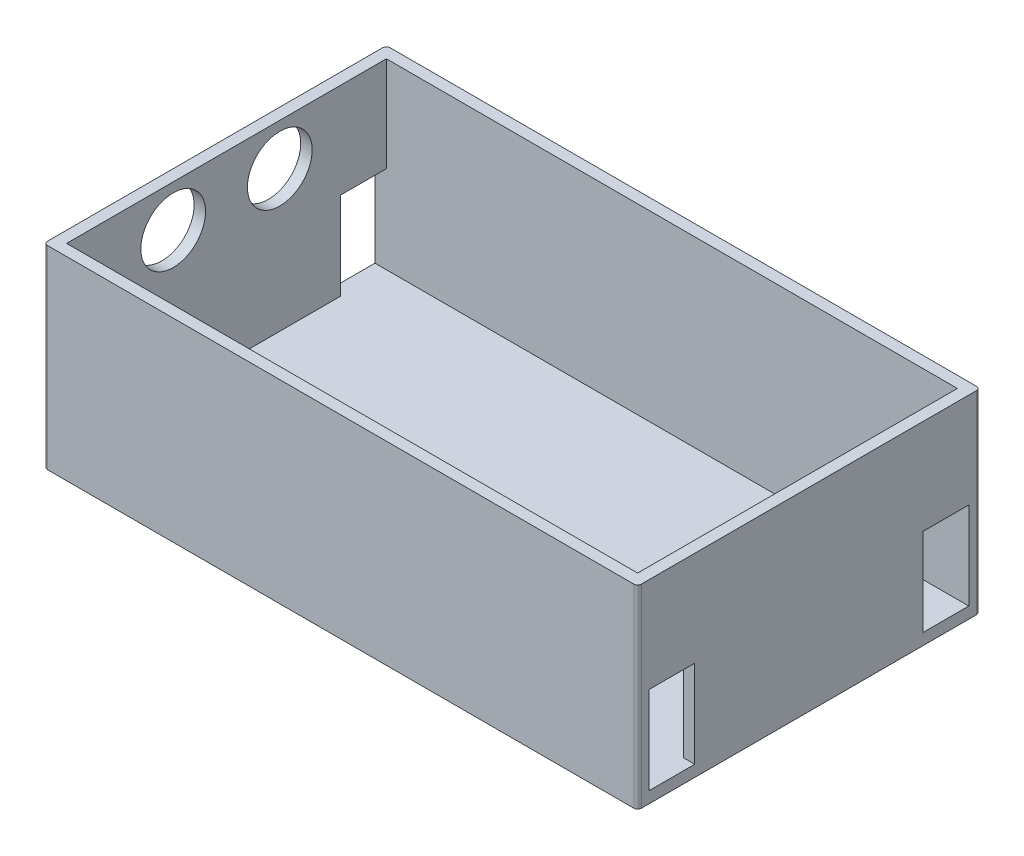
ISO-10303-21;
HEADER;
FILE_DESCRIPTION(('STEP AP214'),'2;1');
FILE_NAME('part.step','',(''),(''),'','','');
FILE_SCHEMA(('AUTOMOTIVE_DESIGN { 1 0 10303 214 1 1 1 1 }'));
ENDSEC;
DATA;
#1=APPLICATION_CONTEXT('core data for automotive mechanical design processes');
#2=APPLICATION_PROTOCOL_DEFINITION('international standard','automotive_design',2000,#1);
#3=PRODUCT_CONTEXT('',#1,'mechanical');
#4=PRODUCT('Part','Part','',(#3));
#5=PRODUCT_RELATED_PRODUCT_CATEGORY('part','',(#4));
#6=PRODUCT_DEFINITION_FORMATION('','',#4);
#7=PRODUCT_DEFINITION_CONTEXT('part definition',#1,'design');
#8=PRODUCT_DEFINITION('design','',#6,#7);
#9=PRODUCT_DEFINITION_SHAPE('','',#8);
#10=(LENGTH_UNIT() NAMED_UNIT(*) SI_UNIT(.MILLI.,.METRE.));
#11=(NAMED_UNIT(*) PLANE_ANGLE_UNIT() SI_UNIT($,.RADIAN.));
#12=(NAMED_UNIT(*) SI_UNIT($,.STERADIAN.) SOLID_ANGLE_UNIT());
#13=UNCERTAINTY_MEASURE_WITH_UNIT(LENGTH_MEASURE(1.E-05),#10,'distance_accuracy_value','');
#14=(GEOMETRIC_REPRESENTATION_CONTEXT(3) GLOBAL_UNCERTAINTY_ASSIGNED_CONTEXT((#13)) GLOBAL_UNIT_ASSIGNED_CONTEXT((#10,
#11,#12)) REPRESENTATION_CONTEXT('',''));
#15=CARTESIAN_POINT('',(0.,0.,0.));
#16=DIRECTION('',(0.,0.,1.));
#17=DIRECTION('',(1.,0.,0.));
#18=AXIS2_PLACEMENT_3D('',#15,#16,#17);
#19=CARTESIAN_POINT('',(0.,3.,0.));
#20=DIRECTION('',(1.,0.,0.));
#21=DIRECTION('',(0.,0.,-1.));
#22=AXIS2_PLACEMENT_3D('',#19,#20,#21);
#23=PLANE('',#22);
#24=CARTESIAN_POINT('',(0.,40.,-59.));
#25=DIRECTION('',(-1.,0.,0.));
#26=DIRECTION('',(0.,0.,1.));
#27=AXIS2_PLACEMENT_3D('',#24,#25,#26);
#28=CIRCLE('',#27,8.5);
#29=CARTESIAN_POINT('',(0.,40.,-50.5));
#30=VERTEX_POINT('',#29);
#31=EDGE_CURVE('E451',#30,#30,#28,.T.);
#32=ORIENTED_EDGE('',*,*,#31,.F.);
#33=EDGE_LOOP('',(#32));
#34=FACE_BOUND('',#33,.T.);
#35=CARTESIAN_POINT('',(0.,40.,-31.));
#36=DIRECTION('',(-1.,0.,0.));
#37=DIRECTION('',(0.,0.,1.));
#38=AXIS2_PLACEMENT_3D('',#35,#36,#37);
#39=CIRCLE('',#38,8.5);
#40=CARTESIAN_POINT('',(0.,40.,-22.5));
#41=VERTEX_POINT('',#40);
#42=EDGE_CURVE('E238',#41,#41,#39,.T.);
#43=ORIENTED_EDGE('',*,*,#42,.F.);
#44=EDGE_LOOP('',(#43));
#45=FACE_BOUND('',#44,.T.);
#46=DIRECTION('',(0.,0.,1.));
#47=VECTOR('',#46,1.);
#48=CARTESIAN_POINT('',(0.,26.,-3.));
#49=LINE('',#48,#47);
#50=CARTESIAN_POINT('',(0.,26.,-15.));
#51=VERTEX_POINT('',#50);
#52=CARTESIAN_POINT('',(0.,26.,-3.));
#53=VERTEX_POINT('',#52);
#54=EDGE_CURVE('E229',#51,#53,#49,.T.);
#55=ORIENTED_EDGE('',*,*,#54,.T.);
#56=DIRECTION('',(0.,-1.,0.));
#57=VECTOR('',#56,1.);
#58=CARTESIAN_POINT('',(0.,26.,-3.));
#59=LINE('',#58,#57);
#60=CARTESIAN_POINT('',(0.,3.,-3.));
#61=VERTEX_POINT('',#60);
#62=EDGE_CURVE('E208',#53,#61,#59,.T.);
#63=ORIENTED_EDGE('',*,*,#62,.T.);
#64=DIRECTION('',(0.,0.,-1.));
#65=VECTOR('',#64,1.);
#66=CARTESIAN_POINT('',(0.,3.,-3.));
#67=LINE('',#66,#65);
#68=CARTESIAN_POINT('',(0.,3.,-15.));
#69=VERTEX_POINT('',#68);
#70=EDGE_CURVE('E220',#61,#69,#67,.T.);
#71=ORIENTED_EDGE('',*,*,#70,.T.);
#72=DIRECTION('',(0.,1.,0.));
#73=VECTOR('',#72,1.);
#74=CARTESIAN_POINT('',(0.,26.,-15.));
#75=LINE('',#74,#73);
#76=EDGE_CURVE('E56',#69,#51,#75,.T.);
#77=ORIENTED_EDGE('',*,*,#76,.T.);
#78=EDGE_LOOP('',(#55,#63,#71,#77));
#79=FACE_BOUND('',#78,.T.);
#80=DIRECTION('',(0.,0.,-1.));
#81=VECTOR('',#80,1.);
#82=CARTESIAN_POINT('',(0.,3.,-87.));
#83=LINE('',#82,#81);
#84=CARTESIAN_POINT('',(0.,3.,-75.));
#85=VERTEX_POINT('',#84);
#86=CARTESIAN_POINT('',(0.,3.,-87.));
#87=VERTEX_POINT('',#86);
#88=EDGE_CURVE('E278',#85,#87,#83,.T.);
#89=ORIENTED_EDGE('',*,*,#88,.T.);
#90=DIRECTION('',(0.,1.,0.));
#91=VECTOR('',#90,1.);
#92=CARTESIAN_POINT('',(0.,3.,-87.));
#93=LINE('',#92,#91);
#94=CARTESIAN_POINT('',(0.,26.,-87.));
#95=VERTEX_POINT('',#94);
#96=EDGE_CURVE('E267',#87,#95,#93,.T.);
#97=ORIENTED_EDGE('',*,*,#96,.T.);
#98=DIRECTION('',(0.,0.,1.));
#99=VECTOR('',#98,1.);
#100=CARTESIAN_POINT('',(0.,26.,-87.));
#101=LINE('',#100,#99);
#102=CARTESIAN_POINT('',(0.,26.,-75.));
#103=VERTEX_POINT('',#102);
#104=EDGE_CURVE('E271',#95,#103,#101,.T.);
#105=ORIENTED_EDGE('',*,*,#104,.T.);
#106=DIRECTION('',(0.,-1.,0.));
#107=VECTOR('',#106,1.);
#108=CARTESIAN_POINT('',(0.,3.,-75.));
#109=LINE('',#108,#107);
#110=EDGE_CURVE('E64',#103,#85,#109,.T.);
#111=ORIENTED_EDGE('',*,*,#110,.T.);
#112=EDGE_LOOP('',(#89,#97,#105,#111));
#113=FACE_BOUND('',#112,.T.);
#114=DIRECTION('',(0.,0.,1.));
#115=VECTOR('',#114,1.);
#116=CARTESIAN_POINT('',(0.,51.,-90.));
#117=LINE('',#116,#115);
#118=CARTESIAN_POINT('',(0.,51.,-89.));
#119=VERTEX_POINT('',#118);
#120=CARTESIAN_POINT('',(0.,51.,-1.00000000000003));
#121=VERTEX_POINT('',#120);
#122=EDGE_CURVE('E370',#119,#121,#117,.T.);
#123=ORIENTED_EDGE('',*,*,#122,.F.);
#124=DIRECTION('',(0.,-1.,0.));
#125=VECTOR('',#124,1.);
#126=CARTESIAN_POINT('',(0.,3.,-89.));
#127=LINE('',#126,#125);
#128=CARTESIAN_POINT('',(0.,0.,-89.));
#129=VERTEX_POINT('',#128);
#130=EDGE_CURVE('E439',#119,#129,#127,.T.);
#131=ORIENTED_EDGE('',*,*,#130,.T.);
#132=DIRECTION('',(0.,0.,1.));
#133=VECTOR('',#132,1.);
#134=CARTESIAN_POINT('',(0.,0.,0.));
#135=LINE('',#134,#133);
#136=CARTESIAN_POINT('',(0.,0.,-1.));
#137=VERTEX_POINT('',#136);
#138=EDGE_CURVE('E382',#129,#137,#135,.T.);
#139=ORIENTED_EDGE('',*,*,#138,.T.);
#140=DIRECTION('',(0.,-1.,0.));
#141=VECTOR('',#140,1.);
#142=CARTESIAN_POINT('',(0.,3.,-1.));
#143=LINE('',#142,#141);
#144=EDGE_CURVE('E436',#137,#121,#143,.F.);
#145=ORIENTED_EDGE('',*,*,#144,.T.);
#146=EDGE_LOOP('',(#123,#131,#139,#145));
#147=FACE_BOUND('',#146,.T.);
#148=ADVANCED_FACE('F38',(#34,#45,#79,#113,#147),#23,.F.);
#149=CARTESIAN_POINT('',(0.,3.,0.));
#150=DIRECTION('',(0.,0.,-1.));
#151=DIRECTION('',(-1.,0.,0.));
#152=AXIS2_PLACEMENT_3D('',#149,#150,#151);
#153=PLANE('',#152);
#154=DIRECTION('',(1.,0.,0.));
#155=VECTOR('',#154,1.);
#156=CARTESIAN_POINT('',(0.,0.,0.));
#157=LINE('',#156,#155);
#158=CARTESIAN_POINT('',(1.,0.,0.));
#159=VERTEX_POINT('',#158);
#160=CARTESIAN_POINT('',(155.,0.,0.));
#161=VERTEX_POINT('',#160);
#162=EDGE_CURVE('E386',#159,#161,#157,.T.);
#163=ORIENTED_EDGE('',*,*,#162,.T.);
#164=DIRECTION('',(0.,-1.,0.));
#165=VECTOR('',#164,1.);
#166=CARTESIAN_POINT('',(155.,3.,0.));
#167=LINE('',#166,#165);
#168=CARTESIAN_POINT('',(155.,51.,0.));
#169=VERTEX_POINT('',#168);
#170=EDGE_CURVE('E48',#161,#169,#167,.F.);
#171=ORIENTED_EDGE('',*,*,#170,.T.);
#172=DIRECTION('',(1.,0.,0.));
#173=VECTOR('',#172,1.);
#174=CARTESIAN_POINT('',(0.,51.,0.));
#175=LINE('',#174,#173);
#176=CARTESIAN_POINT('',(1.,51.,0.));
#177=VERTEX_POINT('',#176);
#178=EDGE_CURVE('E374',#177,#169,#175,.T.);
#179=ORIENTED_EDGE('',*,*,#178,.F.);
#180=DIRECTION('',(0.,-1.,0.));
#181=VECTOR('',#180,1.);
#182=CARTESIAN_POINT('',(1.,3.,0.));
#183=LINE('',#182,#181);
#184=EDGE_CURVE('E443',#177,#159,#183,.T.);
#185=ORIENTED_EDGE('',*,*,#184,.T.);
#186=EDGE_LOOP('',(#163,#171,#179,#185));
#187=FACE_BOUND('',#186,.T.);
#188=ADVANCED_FACE('F467',(#187),#153,.F.);
#189=CARTESIAN_POINT('',(156.,3.,0.));
#190=DIRECTION('',(-1.,0.,0.));
#191=DIRECTION('',(0.,0.,1.));
#192=AXIS2_PLACEMENT_3D('',#189,#190,#191);
#193=PLANE('',#192);
#194=DIRECTION('',(0.,0.,-1.));
#195=VECTOR('',#194,1.);
#196=CARTESIAN_POINT('',(156.,3.,-3.));
#197=LINE('',#196,#195);
#198=CARTESIAN_POINT('',(156.,3.,-3.));
#199=VERTEX_POINT('',#198);
#200=CARTESIAN_POINT('',(156.,3.,-15.));
#201=VERTEX_POINT('',#200);
#202=EDGE_CURVE('E248',#199,#201,#197,.T.);
#203=ORIENTED_EDGE('',*,*,#202,.F.);
#204=DIRECTION('',(0.,-1.,0.));
#205=VECTOR('',#204,1.);
#206=CARTESIAN_POINT('',(156.,26.,-3.));
#207=LINE('',#206,#205);
#208=CARTESIAN_POINT('',(156.,26.,-3.));
#209=VERTEX_POINT('',#208);
#210=EDGE_CURVE('E211',#209,#199,#207,.T.);
#211=ORIENTED_EDGE('',*,*,#210,.F.);
#212=DIRECTION('',(0.,0.,1.));
#213=VECTOR('',#212,1.);
#214=CARTESIAN_POINT('',(156.,26.,-3.));
#215=LINE('',#214,#213);
#216=CARTESIAN_POINT('',(156.,26.,-15.));
#217=VERTEX_POINT('',#216);
#218=EDGE_CURVE('E231',#217,#209,#215,.T.);
#219=ORIENTED_EDGE('',*,*,#218,.F.);
#220=DIRECTION('',(0.,1.,0.));
#221=VECTOR('',#220,1.);
#222=CARTESIAN_POINT('',(156.,26.,-15.));
#223=LINE('',#222,#221);
#224=EDGE_CURVE('E235',#201,#217,#223,.T.);
#225=ORIENTED_EDGE('',*,*,#224,.F.);
#226=EDGE_LOOP('',(#203,#211,#219,#225));
#227=FACE_BOUND('',#226,.T.);
#228=DIRECTION('',(0.,0.,1.));
#229=VECTOR('',#228,1.);
#230=CARTESIAN_POINT('',(156.,26.,-87.));
#231=LINE('',#230,#229);
#232=CARTESIAN_POINT('',(156.,26.,-87.));
#233=VERTEX_POINT('',#232);
#234=CARTESIAN_POINT('',(156.,26.,-75.));
#235=VERTEX_POINT('',#234);
#236=EDGE_CURVE('E286',#233,#235,#231,.T.);
#237=ORIENTED_EDGE('',*,*,#236,.F.);
#238=DIRECTION('',(0.,1.,0.));
#239=VECTOR('',#238,1.);
#240=CARTESIAN_POINT('',(156.,3.,-87.));
#241=LINE('',#240,#239);
#242=CARTESIAN_POINT('',(156.,3.,-87.));
#243=VERTEX_POINT('',#242);
#244=EDGE_CURVE('E283',#243,#233,#241,.T.);
#245=ORIENTED_EDGE('',*,*,#244,.F.);
#246=DIRECTION('',(0.,0.,-1.));
#247=VECTOR('',#246,1.);
#248=CARTESIAN_POINT('',(156.,3.,-87.));
#249=LINE('',#248,#247);
#250=CARTESIAN_POINT('',(156.,3.,-75.));
#251=VERTEX_POINT('',#250);
#252=EDGE_CURVE('E272',#251,#243,#249,.T.);
#253=ORIENTED_EDGE('',*,*,#252,.F.);
#254=DIRECTION('',(0.,-1.,0.));
#255=VECTOR('',#254,1.);
#256=CARTESIAN_POINT('',(156.,3.,-75.));
#257=LINE('',#256,#255);
#258=EDGE_CURVE('E290',#235,#251,#257,.T.);
#259=ORIENTED_EDGE('',*,*,#258,.F.);
#260=EDGE_LOOP('',(#237,#245,#253,#259));
#261=FACE_BOUND('',#260,.T.);
#262=DIRECTION('',(0.,0.,-1.));
#263=VECTOR('',#262,1.);
#264=CARTESIAN_POINT('',(156.,0.,0.));
#265=LINE('',#264,#263);
#266=CARTESIAN_POINT('',(156.,0.,-1.));
#267=VERTEX_POINT('',#266);
#268=CARTESIAN_POINT('',(156.,0.,-89.));
#269=VERTEX_POINT('',#268);
#270=EDGE_CURVE('E390',#267,#269,#265,.T.);
#271=ORIENTED_EDGE('',*,*,#270,.T.);
#272=DIRECTION('',(0.,-1.,0.));
#273=VECTOR('',#272,1.);
#274=CARTESIAN_POINT('',(156.,3.,-89.));
#275=LINE('',#274,#273);
#276=CARTESIAN_POINT('',(156.,51.,-89.));
#277=VERTEX_POINT('',#276);
#278=EDGE_CURVE('E421',#269,#277,#275,.F.);
#279=ORIENTED_EDGE('',*,*,#278,.T.);
#280=DIRECTION('',(0.,0.,-1.));
#281=VECTOR('',#280,1.);
#282=CARTESIAN_POINT('',(156.,51.,0.));
#283=LINE('',#282,#281);
#284=CARTESIAN_POINT('',(156.,51.,-1.));
#285=VERTEX_POINT('',#284);
#286=EDGE_CURVE('E378',#285,#277,#283,.T.);
#287=ORIENTED_EDGE('',*,*,#286,.F.);
#288=DIRECTION('',(0.,-1.,0.));
#289=VECTOR('',#288,1.);
#290=CARTESIAN_POINT('',(156.,3.,-1.));
#291=LINE('',#290,#289);
#292=EDGE_CURVE('E417',#285,#267,#291,.T.);
#293=ORIENTED_EDGE('',*,*,#292,.T.);
#294=EDGE_LOOP('',(#271,#279,#287,#293));
#295=FACE_BOUND('',#294,.T.);
#296=ADVANCED_FACE('F475',(#227,#261,#295),#193,.F.);
#297=CARTESIAN_POINT('',(0.,3.,-90.));
#298=DIRECTION('',(0.,0.,1.));
#299=DIRECTION('',(1.,0.,0.));
#300=AXIS2_PLACEMENT_3D('',#297,#298,#299);
#301=PLANE('',#300);
#302=DIRECTION('',(-1.,0.,0.));
#303=VECTOR('',#302,1.);
#304=CARTESIAN_POINT('',(156.,51.,-90.));
#305=LINE('',#304,#303);
#306=CARTESIAN_POINT('',(155.,51.,-90.));
#307=VERTEX_POINT('',#306);
#308=CARTESIAN_POINT('',(1.,51.,-90.));
#309=VERTEX_POINT('',#308);
#310=EDGE_CURVE('E366',#307,#309,#305,.T.);
#311=ORIENTED_EDGE('',*,*,#310,.F.);
#312=DIRECTION('',(0.,-1.,0.));
#313=VECTOR('',#312,1.);
#314=CARTESIAN_POINT('',(155.,3.,-90.));
#315=LINE('',#314,#313);
#316=CARTESIAN_POINT('',(155.,0.,-90.));
#317=VERTEX_POINT('',#316);
#318=EDGE_CURVE('E401',#307,#317,#315,.T.);
#319=ORIENTED_EDGE('',*,*,#318,.T.);
#320=DIRECTION('',(-1.,0.,0.));
#321=VECTOR('',#320,1.);
#322=CARTESIAN_POINT('',(0.,0.,-90.));
#323=LINE('',#322,#321);
#324=CARTESIAN_POINT('',(1.,0.,-90.));
#325=VERTEX_POINT('',#324);
#326=EDGE_CURVE('E394',#317,#325,#323,.T.);
#327=ORIENTED_EDGE('',*,*,#326,.T.);
#328=DIRECTION('',(0.,-1.,0.));
#329=VECTOR('',#328,1.);
#330=CARTESIAN_POINT('',(1.,3.,-90.));
#331=LINE('',#330,#329);
#332=EDGE_CURVE('E398',#325,#309,#331,.F.);
#333=ORIENTED_EDGE('',*,*,#332,.T.);
#334=EDGE_LOOP('',(#311,#319,#327,#333));
#335=FACE_BOUND('',#334,.T.);
#336=ADVANCED_FACE('F511',(#335),#301,.F.);
#337=CARTESIAN_POINT('',(0.,0.,0.));
#338=DIRECTION('',(0.,-1.,0.));
#339=DIRECTION('',(0.,0.,-1.));
#340=AXIS2_PLACEMENT_3D('',#337,#338,#339);
#341=PLANE('',#340);
#342=ORIENTED_EDGE('',*,*,#326,.F.);
#343=CARTESIAN_POINT('',(155.,0.,-89.));
#344=DIRECTION('',(0.,-1.,0.));
#345=DIRECTION('',(0.,0.,-1.));
#346=AXIS2_PLACEMENT_3D('',#343,#344,#345);
#347=CIRCLE('',#346,1.);
#348=EDGE_CURVE('E414',#317,#269,#347,.T.);
#349=ORIENTED_EDGE('',*,*,#348,.T.);
#350=ORIENTED_EDGE('',*,*,#270,.F.);
#351=CARTESIAN_POINT('',(155.,0.,-1.));
#352=DIRECTION('',(0.,-1.,0.));
#353=DIRECTION('',(0.,0.,-1.));
#354=AXIS2_PLACEMENT_3D('',#351,#352,#353);
#355=CIRCLE('',#354,1.);
#356=EDGE_CURVE('E408',#267,#161,#355,.T.);
#357=ORIENTED_EDGE('',*,*,#356,.T.);
#358=ORIENTED_EDGE('',*,*,#162,.F.);
#359=CARTESIAN_POINT('',(1.,0.,-1.));
#360=DIRECTION('',(0.,-1.,0.));
#361=DIRECTION('',(0.,0.,-1.));
#362=AXIS2_PLACEMENT_3D('',#359,#360,#361);
#363=CIRCLE('',#362,1.);
#364=EDGE_CURVE('E405',#159,#137,#363,.T.);
#365=ORIENTED_EDGE('',*,*,#364,.T.);
#366=ORIENTED_EDGE('',*,*,#138,.F.);
#367=CARTESIAN_POINT('',(1.,0.,-89.));
#368=DIRECTION('',(0.,-1.,0.));
#369=DIRECTION('',(0.,0.,-1.));
#370=AXIS2_PLACEMENT_3D('',#367,#368,#369);
#371=CIRCLE('',#370,1.);
#372=EDGE_CURVE('E411',#129,#325,#371,.T.);
#373=ORIENTED_EDGE('',*,*,#372,.T.);
#374=EDGE_LOOP('',(#342,#349,#350,#357,#358,#365,#366,#373));
#375=FACE_BOUND('',#374,.T.);
#376=ADVANCED_FACE('F523',(#375),#341,.T.);
#377=CARTESIAN_POINT('',(0.,51.,0.));
#378=DIRECTION('',(0.,1.,0.));
#379=DIRECTION('',(0.,0.,1.));
#380=AXIS2_PLACEMENT_3D('',#377,#378,#379);
#381=PLANE('',#380);
#382=ORIENTED_EDGE('',*,*,#286,.T.);
#383=CARTESIAN_POINT('',(155.,51.,-89.));
#384=DIRECTION('',(0.,1.,0.));
#385=DIRECTION('',(0.,0.,1.));
#386=AXIS2_PLACEMENT_3D('',#383,#384,#385);
#387=CIRCLE('',#386,1.);
#388=EDGE_CURVE('E433',#277,#307,#387,.T.);
#389=ORIENTED_EDGE('',*,*,#388,.T.);
#390=ORIENTED_EDGE('',*,*,#310,.T.);
#391=CARTESIAN_POINT('',(1.,51.,-89.));
#392=DIRECTION('',(0.,1.,0.));
#393=DIRECTION('',(0.,0.,1.));
#394=AXIS2_PLACEMENT_3D('',#391,#392,#393);
#395=CIRCLE('',#394,1.);
#396=EDGE_CURVE('E430',#309,#119,#395,.T.);
#397=ORIENTED_EDGE('',*,*,#396,.T.);
#398=ORIENTED_EDGE('',*,*,#122,.T.);
#399=CARTESIAN_POINT('',(1.,51.,-1.));
#400=DIRECTION('',(0.,1.,0.));
#401=DIRECTION('',(0.,0.,1.));
#402=AXIS2_PLACEMENT_3D('',#399,#400,#401);
#403=CIRCLE('',#402,1.);
#404=EDGE_CURVE('E424',#121,#177,#403,.T.);
#405=ORIENTED_EDGE('',*,*,#404,.T.);
#406=ORIENTED_EDGE('',*,*,#178,.T.);
#407=CARTESIAN_POINT('',(155.,51.,-1.));
#408=DIRECTION('',(0.,1.,0.));
#409=DIRECTION('',(0.,0.,1.));
#410=AXIS2_PLACEMENT_3D('',#407,#408,#409);
#411=CIRCLE('',#410,1.);
#412=EDGE_CURVE('E427',#169,#285,#411,.T.);
#413=ORIENTED_EDGE('',*,*,#412,.T.);
#414=EDGE_LOOP('',(#382,#389,#390,#397,#398,#405,#406,#413));
#415=FACE_BOUND('',#414,.T.);
#416=DIRECTION('',(1.,0.,0.));
#417=VECTOR('',#416,1.);
#418=CARTESIAN_POINT('',(3.00000000000001,51.,-3.));
#419=LINE('',#418,#417);
#420=CARTESIAN_POINT('',(3.00000000000001,51.,-3.));
#421=VERTEX_POINT('',#420);
#422=CARTESIAN_POINT('',(153.,51.,-3.));
#423=VERTEX_POINT('',#422);
#424=EDGE_CURVE('E333',#421,#423,#419,.T.);
#425=ORIENTED_EDGE('',*,*,#424,.F.);
#426=DIRECTION('',(0.,0.,1.));
#427=VECTOR('',#426,1.);
#428=CARTESIAN_POINT('',(3.,51.,-87.));
#429=LINE('',#428,#427);
#430=CARTESIAN_POINT('',(3.,51.,-87.));
#431=VERTEX_POINT('',#430);
#432=EDGE_CURVE('E330',#431,#421,#429,.T.);
#433=ORIENTED_EDGE('',*,*,#432,.F.);
#434=DIRECTION('',(-1.,0.,0.));
#435=VECTOR('',#434,1.);
#436=CARTESIAN_POINT('',(3.,51.,-87.));
#437=LINE('',#436,#435);
#438=CARTESIAN_POINT('',(153.,51.,-87.));
#439=VERTEX_POINT('',#438);
#440=EDGE_CURVE('E341',#439,#431,#437,.T.);
#441=ORIENTED_EDGE('',*,*,#440,.F.);
#442=DIRECTION('',(0.,0.,-1.));
#443=VECTOR('',#442,1.);
#444=CARTESIAN_POINT('',(153.,51.,-87.));
#445=LINE('',#444,#443);
#446=EDGE_CURVE('E337',#423,#439,#445,.T.);
#447=ORIENTED_EDGE('',*,*,#446,.F.);
#448=EDGE_LOOP('',(#425,#433,#441,#447));
#449=FACE_BOUND('',#448,.T.);
#450=ADVANCED_FACE('F500',(#415,#449),#381,.T.);
#451=CARTESIAN_POINT('',(3.,51.,-87.));
#452=DIRECTION('',(1.,0.,0.));
#453=DIRECTION('',(0.,0.,-1.));
#454=AXIS2_PLACEMENT_3D('',#451,#452,#453);
#455=PLANE('',#454);
#456=CARTESIAN_POINT('',(3.,40.,-59.));
#457=DIRECTION('',(1.,0.,0.));
#458=DIRECTION('',(0.,0.,-1.));
#459=AXIS2_PLACEMENT_3D('',#456,#457,#458);
#460=CIRCLE('',#459,8.5);
#461=CARTESIAN_POINT('',(3.,40.,-67.5));
#462=VERTEX_POINT('',#461);
#463=EDGE_CURVE('E42',#462,#462,#460,.T.);
#464=ORIENTED_EDGE('',*,*,#463,.F.);
#465=EDGE_LOOP('',(#464));
#466=FACE_BOUND('',#465,.T.);
#467=CARTESIAN_POINT('',(3.00000000000001,40.,-31.));
#468=DIRECTION('',(1.,0.,0.));
#469=DIRECTION('',(0.,0.,-1.));
#470=AXIS2_PLACEMENT_3D('',#467,#468,#469);
#471=CIRCLE('',#470,8.5);
#472=CARTESIAN_POINT('',(3.00000000000001,40.,-39.5));
#473=VERTEX_POINT('',#472);
#474=EDGE_CURVE('E448',#473,#473,#471,.T.);
#475=ORIENTED_EDGE('',*,*,#474,.F.);
#476=EDGE_LOOP('',(#475));
#477=FACE_BOUND('',#476,.T.);
#478=DIRECTION('',(0.,0.,1.));
#479=VECTOR('',#478,1.);
#480=CARTESIAN_POINT('',(3.,26.,-87.));
#481=LINE('',#480,#479);
#482=CARTESIAN_POINT('',(3.00000000000001,26.,-15.));
#483=VERTEX_POINT('',#482);
#484=CARTESIAN_POINT('',(3.00000000000001,26.,-3.));
#485=VERTEX_POINT('',#484);
#486=EDGE_CURVE('E327',#483,#485,#481,.T.);
#487=ORIENTED_EDGE('',*,*,#486,.F.);
#488=DIRECTION('',(0.,1.,0.));
#489=VECTOR('',#488,1.);
#490=CARTESIAN_POINT('',(3.00000000000001,51.,-15.));
#491=LINE('',#490,#489);
#492=CARTESIAN_POINT('',(3.,3.,-15.));
#493=VERTEX_POINT('',#492);
#494=EDGE_CURVE('E318',#493,#483,#491,.T.);
#495=ORIENTED_EDGE('',*,*,#494,.F.);
#496=DIRECTION('',(0.,0.,1.));
#497=VECTOR('',#496,1.);
#498=CARTESIAN_POINT('',(3.,3.,-87.));
#499=LINE('',#498,#497);
#500=CARTESIAN_POINT('',(3.,3.,-75.));
#501=VERTEX_POINT('',#500);
#502=EDGE_CURVE('E217',#501,#493,#499,.T.);
#503=ORIENTED_EDGE('',*,*,#502,.F.);
#504=DIRECTION('',(0.,-1.,0.));
#505=VECTOR('',#504,1.);
#506=CARTESIAN_POINT('',(3.,51.,-75.));
#507=LINE('',#506,#505);
#508=CARTESIAN_POINT('',(3.,26.,-75.));
#509=VERTEX_POINT('',#508);
#510=EDGE_CURVE('E311',#509,#501,#507,.T.);
#511=ORIENTED_EDGE('',*,*,#510,.F.);
#512=DIRECTION('',(0.,0.,1.));
#513=VECTOR('',#512,1.);
#514=CARTESIAN_POINT('',(3.,26.,-87.));
#515=LINE('',#514,#513);
#516=CARTESIAN_POINT('',(3.,26.,-87.));
#517=VERTEX_POINT('',#516);
#518=EDGE_CURVE('E324',#517,#509,#515,.T.);
#519=ORIENTED_EDGE('',*,*,#518,.F.);
#520=DIRECTION('',(0.,-1.,0.));
#521=VECTOR('',#520,1.);
#522=CARTESIAN_POINT('',(3.,51.,-87.));
#523=LINE('',#522,#521);
#524=EDGE_CURVE('E344',#431,#517,#523,.T.);
#525=ORIENTED_EDGE('',*,*,#524,.F.);
#526=ORIENTED_EDGE('',*,*,#432,.T.);
#527=DIRECTION('',(0.,-1.,0.));
#528=VECTOR('',#527,1.);
#529=CARTESIAN_POINT('',(3.00000000000001,51.,-3.));
#530=LINE('',#529,#528);
#531=EDGE_CURVE('E362',#421,#485,#530,.T.);
#532=ORIENTED_EDGE('',*,*,#531,.T.);
#533=EDGE_LOOP('',(#487,#495,#503,#511,#519,#525,#526,#532));
#534=FACE_BOUND('',#533,.T.);
#535=ADVANCED_FACE('F530',(#466,#477,#534),#455,.T.);
#536=CARTESIAN_POINT('',(3.00000000000001,51.,-3.));
#537=DIRECTION('',(0.,0.,-1.));
#538=DIRECTION('',(-1.,0.,0.));
#539=AXIS2_PLACEMENT_3D('',#536,#537,#538);
#540=PLANE('',#539);
#541=DIRECTION('',(0.,-1.,0.));
#542=VECTOR('',#541,1.);
#543=CARTESIAN_POINT('',(153.,51.,-3.));
#544=LINE('',#543,#542);
#545=CARTESIAN_POINT('',(153.,26.,-3.));
#546=VERTEX_POINT('',#545);
#547=EDGE_CURVE('E359',#423,#546,#544,.T.);
#548=ORIENTED_EDGE('',*,*,#547,.T.);
#549=DIRECTION('',(1.,0.,0.));
#550=VECTOR('',#549,1.);
#551=CARTESIAN_POINT('',(0.,26.,-3.));
#552=LINE('',#551,#550);
#553=EDGE_CURVE('E259',#546,#209,#552,.T.);
#554=ORIENTED_EDGE('',*,*,#553,.T.);
#555=ORIENTED_EDGE('',*,*,#210,.T.);
#556=DIRECTION('',(1.,0.,0.));
#557=VECTOR('',#556,1.);
#558=CARTESIAN_POINT('',(3.00000000000001,3.,-3.));
#559=LINE('',#558,#557);
#560=EDGE_CURVE('E202',#61,#199,#559,.T.);
#561=ORIENTED_EDGE('',*,*,#560,.F.);
#562=ORIENTED_EDGE('',*,*,#62,.F.);
#563=EDGE_CURVE('E255',#53,#485,#552,.T.);
#564=ORIENTED_EDGE('',*,*,#563,.T.);
#565=ORIENTED_EDGE('',*,*,#531,.F.);
#566=ORIENTED_EDGE('',*,*,#424,.T.);
#567=EDGE_LOOP('',(#548,#554,#555,#561,#562,#564,#565,#566));
#568=FACE_BOUND('',#567,.T.);
#569=ADVANCED_FACE('F205',(#568),#540,.T.);
#570=CARTESIAN_POINT('',(153.,51.,-87.));
#571=DIRECTION('',(-1.,0.,0.));
#572=DIRECTION('',(0.,0.,1.));
#573=AXIS2_PLACEMENT_3D('',#570,#571,#572);
#574=PLANE('',#573);
#575=DIRECTION('',(0.,0.,-1.));
#576=VECTOR('',#575,1.);
#577=CARTESIAN_POINT('',(153.,26.,-87.));
#578=LINE('',#577,#576);
#579=CARTESIAN_POINT('',(153.,26.,-15.));
#580=VERTEX_POINT('',#579);
#581=EDGE_CURVE('E11',#546,#580,#578,.T.);
#582=ORIENTED_EDGE('',*,*,#581,.F.);
#583=ORIENTED_EDGE('',*,*,#547,.F.);
#584=ORIENTED_EDGE('',*,*,#446,.T.);
#585=DIRECTION('',(0.,-1.,0.));
#586=VECTOR('',#585,1.);
#587=CARTESIAN_POINT('',(153.,51.,-87.));
#588=LINE('',#587,#586);
#589=CARTESIAN_POINT('',(153.,26.,-87.));
#590=VERTEX_POINT('',#589);
#591=EDGE_CURVE('E355',#439,#590,#588,.T.);
#592=ORIENTED_EDGE('',*,*,#591,.T.);
#593=DIRECTION('',(0.,0.,-1.));
#594=VECTOR('',#593,1.);
#595=CARTESIAN_POINT('',(153.,26.,-87.));
#596=LINE('',#595,#594);
#597=CARTESIAN_POINT('',(153.,26.,-75.));
#598=VERTEX_POINT('',#597);
#599=EDGE_CURVE('E321',#598,#590,#596,.T.);
#600=ORIENTED_EDGE('',*,*,#599,.F.);
#601=DIRECTION('',(0.,1.,0.));
#602=VECTOR('',#601,1.);
#603=CARTESIAN_POINT('',(153.,51.,-75.));
#604=LINE('',#603,#602);
#605=CARTESIAN_POINT('',(153.,3.,-75.));
#606=VERTEX_POINT('',#605);
#607=EDGE_CURVE('E258',#606,#598,#604,.T.);
#608=ORIENTED_EDGE('',*,*,#607,.F.);
#609=DIRECTION('',(0.,0.,-1.));
#610=VECTOR('',#609,1.);
#611=CARTESIAN_POINT('',(153.,3.,-87.));
#612=LINE('',#611,#610);
#613=CARTESIAN_POINT('',(153.,3.,-15.));
#614=VERTEX_POINT('',#613);
#615=EDGE_CURVE('E216',#614,#606,#612,.T.);
#616=ORIENTED_EDGE('',*,*,#615,.F.);
#617=DIRECTION('',(0.,-1.,0.));
#618=VECTOR('',#617,1.);
#619=CARTESIAN_POINT('',(153.,51.,-15.));
#620=LINE('',#619,#618);
#621=EDGE_CURVE('E314',#580,#614,#620,.T.);
#622=ORIENTED_EDGE('',*,*,#621,.F.);
#623=EDGE_LOOP('',(#582,#583,#584,#592,#600,#608,#616,#622));
#624=FACE_BOUND('',#623,.T.);
#625=ADVANCED_FACE('F558',(#624),#574,.T.);
#626=CARTESIAN_POINT('',(3.,51.,-87.));
#627=DIRECTION('',(0.,0.,1.));
#628=DIRECTION('',(1.,0.,0.));
#629=AXIS2_PLACEMENT_3D('',#626,#627,#628);
#630=PLANE('',#629);
#631=ORIENTED_EDGE('',*,*,#524,.T.);
#632=DIRECTION('',(1.,0.,0.));
#633=VECTOR('',#632,1.);
#634=CARTESIAN_POINT('',(0.,26.,-87.));
#635=LINE('',#634,#633);
#636=EDGE_CURVE('E305',#95,#517,#635,.T.);
#637=ORIENTED_EDGE('',*,*,#636,.F.);
#638=ORIENTED_EDGE('',*,*,#96,.F.);
#639=DIRECTION('',(-1.,0.,0.));
#640=VECTOR('',#639,1.);
#641=CARTESIAN_POINT('',(3.,3.,-87.));
#642=LINE('',#641,#640);
#643=EDGE_CURVE('E334',#243,#87,#642,.T.);
#644=ORIENTED_EDGE('',*,*,#643,.F.);
#645=ORIENTED_EDGE('',*,*,#244,.T.);
#646=EDGE_CURVE('E282',#590,#233,#635,.T.);
#647=ORIENTED_EDGE('',*,*,#646,.F.);
#648=ORIENTED_EDGE('',*,*,#591,.F.);
#649=ORIENTED_EDGE('',*,*,#440,.T.);
#650=EDGE_LOOP('',(#631,#637,#638,#644,#645,#647,#648,#649));
#651=FACE_BOUND('',#650,.T.);
#652=ADVANCED_FACE('F562',(#651),#630,.T.);
#653=CARTESIAN_POINT('',(0.,3.,0.));
#654=DIRECTION('',(0.,-1.,0.));
#655=DIRECTION('',(0.,0.,-1.));
#656=AXIS2_PLACEMENT_3D('',#653,#654,#655);
#657=PLANE('',#656);
#658=ORIENTED_EDGE('',*,*,#502,.T.);
#659=DIRECTION('',(1.,0.,0.));
#660=VECTOR('',#659,1.);
#661=CARTESIAN_POINT('',(0.,3.,-15.));
#662=LINE('',#661,#660);
#663=EDGE_CURVE('E223',#69,#493,#662,.T.);
#664=ORIENTED_EDGE('',*,*,#663,.F.);
#665=ORIENTED_EDGE('',*,*,#70,.F.);
#666=ORIENTED_EDGE('',*,*,#560,.T.);
#667=ORIENTED_EDGE('',*,*,#202,.T.);
#668=EDGE_CURVE('E245',#614,#201,#662,.T.);
#669=ORIENTED_EDGE('',*,*,#668,.F.);
#670=ORIENTED_EDGE('',*,*,#615,.T.);
#671=DIRECTION('',(1.,0.,0.));
#672=VECTOR('',#671,1.);
#673=CARTESIAN_POINT('',(0.,3.,-75.));
#674=LINE('',#673,#672);
#675=EDGE_CURVE('E300',#606,#251,#674,.T.);
#676=ORIENTED_EDGE('',*,*,#675,.T.);
#677=ORIENTED_EDGE('',*,*,#252,.T.);
#678=ORIENTED_EDGE('',*,*,#643,.T.);
#679=ORIENTED_EDGE('',*,*,#88,.F.);
#680=EDGE_CURVE('E249',#85,#501,#674,.T.);
#681=ORIENTED_EDGE('',*,*,#680,.T.);
#682=EDGE_LOOP('',(#658,#664,#665,#666,#667,#669,#670,#676,#677,#678,#679,#681));
#683=FACE_BOUND('',#682,.T.);
#684=ADVANCED_FACE('F222',(#683),#657,.F.);
#685=CARTESIAN_POINT('',(155.,3.,-89.));
#686=DIRECTION('',(0.,-1.,0.));
#687=DIRECTION('',(0.,0.,-1.));
#688=AXIS2_PLACEMENT_3D('',#685,#686,#687);
#689=CYLINDRICAL_SURFACE('',#688,1.);
#690=ORIENTED_EDGE('',*,*,#388,.F.);
#691=ORIENTED_EDGE('',*,*,#278,.F.);
#692=ORIENTED_EDGE('',*,*,#348,.F.);
#693=ORIENTED_EDGE('',*,*,#318,.F.);
#694=EDGE_LOOP('',(#690,#691,#692,#693));
#695=FACE_BOUND('',#694,.T.);
#696=ADVANCED_FACE('F480',(#695),#689,.T.);
#697=CARTESIAN_POINT('',(1.,3.,-89.));
#698=DIRECTION('',(0.,-1.,0.));
#699=DIRECTION('',(0.,0.,-1.));
#700=AXIS2_PLACEMENT_3D('',#697,#698,#699);
#701=CYLINDRICAL_SURFACE('',#700,1.);
#702=ORIENTED_EDGE('',*,*,#396,.F.);
#703=ORIENTED_EDGE('',*,*,#332,.F.);
#704=ORIENTED_EDGE('',*,*,#372,.F.);
#705=ORIENTED_EDGE('',*,*,#130,.F.);
#706=EDGE_LOOP('',(#702,#703,#704,#705));
#707=FACE_BOUND('',#706,.T.);
#708=ADVANCED_FACE('F483',(#707),#701,.T.);
#709=CARTESIAN_POINT('',(155.,3.,-1.));
#710=DIRECTION('',(0.,-1.,0.));
#711=DIRECTION('',(0.,0.,-1.));
#712=AXIS2_PLACEMENT_3D('',#709,#710,#711);
#713=CYLINDRICAL_SURFACE('',#712,1.);
#714=ORIENTED_EDGE('',*,*,#412,.F.);
#715=ORIENTED_EDGE('',*,*,#170,.F.);
#716=ORIENTED_EDGE('',*,*,#356,.F.);
#717=ORIENTED_EDGE('',*,*,#292,.F.);
#718=EDGE_LOOP('',(#714,#715,#716,#717));
#719=FACE_BOUND('',#718,.T.);
#720=ADVANCED_FACE('F486',(#719),#713,.T.);
#721=CARTESIAN_POINT('',(1.,3.,-1.));
#722=DIRECTION('',(0.,-1.,0.));
#723=DIRECTION('',(0.,0.,-1.));
#724=AXIS2_PLACEMENT_3D('',#721,#722,#723);
#725=CYLINDRICAL_SURFACE('',#724,1.);
#726=ORIENTED_EDGE('',*,*,#404,.F.);
#727=ORIENTED_EDGE('',*,*,#144,.F.);
#728=ORIENTED_EDGE('',*,*,#364,.F.);
#729=ORIENTED_EDGE('',*,*,#184,.F.);
#730=EDGE_LOOP('',(#726,#727,#728,#729));
#731=FACE_BOUND('',#730,.T.);
#732=ADVANCED_FACE('F40',(#731),#725,.T.);
#733=CARTESIAN_POINT('',(0.,26.,-87.));
#734=DIRECTION('',(0.,1.,0.));
#735=DIRECTION('',(0.,0.,1.));
#736=AXIS2_PLACEMENT_3D('',#733,#734,#735);
#737=PLANE('',#736);
#738=ORIENTED_EDGE('',*,*,#599,.T.);
#739=ORIENTED_EDGE('',*,*,#646,.T.);
#740=ORIENTED_EDGE('',*,*,#236,.T.);
#741=DIRECTION('',(1.,0.,0.));
#742=VECTOR('',#741,1.);
#743=CARTESIAN_POINT('',(0.,26.,-75.));
#744=LINE('',#743,#742);
#745=EDGE_CURVE('E304',#598,#235,#744,.T.);
#746=ORIENTED_EDGE('',*,*,#745,.F.);
#747=EDGE_LOOP('',(#738,#739,#740,#746));
#748=FACE_BOUND('',#747,.T.);
#749=ADVANCED_FACE('F493',(#748),#737,.F.);
#750=CARTESIAN_POINT('',(0.,3.,-75.));
#751=DIRECTION('',(0.,0.,1.));
#752=DIRECTION('',(1.,0.,0.));
#753=AXIS2_PLACEMENT_3D('',#750,#751,#752);
#754=PLANE('',#753);
#755=ORIENTED_EDGE('',*,*,#607,.T.);
#756=ORIENTED_EDGE('',*,*,#745,.T.);
#757=ORIENTED_EDGE('',*,*,#258,.T.);
#758=ORIENTED_EDGE('',*,*,#675,.F.);
#759=EDGE_LOOP('',(#755,#756,#757,#758));
#760=FACE_BOUND('',#759,.T.);
#761=ADVANCED_FACE('F555',(#760),#754,.F.);
#762=CARTESIAN_POINT('',(0.,26.,-15.));
#763=DIRECTION('',(0.,0.,-1.));
#764=DIRECTION('',(-1.,0.,0.));
#765=AXIS2_PLACEMENT_3D('',#762,#763,#764);
#766=PLANE('',#765);
#767=ORIENTED_EDGE('',*,*,#621,.T.);
#768=ORIENTED_EDGE('',*,*,#668,.T.);
#769=ORIENTED_EDGE('',*,*,#224,.T.);
#770=DIRECTION('',(1.,0.,0.));
#771=VECTOR('',#770,1.);
#772=CARTESIAN_POINT('',(0.,26.,-15.));
#773=LINE('',#772,#771);
#774=EDGE_CURVE('E264',#580,#217,#773,.T.);
#775=ORIENTED_EDGE('',*,*,#774,.F.);
#776=EDGE_LOOP('',(#767,#768,#769,#775));
#777=FACE_BOUND('',#776,.T.);
#778=ADVANCED_FACE('F576',(#777),#766,.F.);
#779=CARTESIAN_POINT('',(0.,26.,-3.));
#780=DIRECTION('',(0.,1.,0.));
#781=DIRECTION('',(0.,0.,1.));
#782=AXIS2_PLACEMENT_3D('',#779,#780,#781);
#783=PLANE('',#782);
#784=ORIENTED_EDGE('',*,*,#581,.T.);
#785=ORIENTED_EDGE('',*,*,#774,.T.);
#786=ORIENTED_EDGE('',*,*,#218,.T.);
#787=ORIENTED_EDGE('',*,*,#553,.F.);
#788=EDGE_LOOP('',(#784,#785,#786,#787));
#789=FACE_BOUND('',#788,.T.);
#790=ADVANCED_FACE('F574',(#789),#783,.F.);
#791=ORIENTED_EDGE('',*,*,#518,.T.);
#792=EDGE_CURVE('E301',#103,#509,#744,.T.);
#793=ORIENTED_EDGE('',*,*,#792,.F.);
#794=ORIENTED_EDGE('',*,*,#104,.F.);
#795=ORIENTED_EDGE('',*,*,#636,.T.);
#796=EDGE_LOOP('',(#791,#793,#794,#795));
#797=FACE_BOUND('',#796,.T.);
#798=ADVANCED_FACE('F588',(#797),#737,.F.);
#799=ORIENTED_EDGE('',*,*,#510,.T.);
#800=ORIENTED_EDGE('',*,*,#680,.F.);
#801=ORIENTED_EDGE('',*,*,#110,.F.);
#802=ORIENTED_EDGE('',*,*,#792,.T.);
#803=EDGE_LOOP('',(#799,#800,#801,#802));
#804=FACE_BOUND('',#803,.T.);
#805=ADVANCED_FACE('F592',(#804),#754,.F.);
#806=ORIENTED_EDGE('',*,*,#486,.T.);
#807=ORIENTED_EDGE('',*,*,#563,.F.);
#808=ORIENTED_EDGE('',*,*,#54,.F.);
#809=EDGE_CURVE('E260',#51,#483,#773,.T.);
#810=ORIENTED_EDGE('',*,*,#809,.T.);
#811=EDGE_LOOP('',(#806,#807,#808,#810));
#812=FACE_BOUND('',#811,.T.);
#813=ADVANCED_FACE('F590',(#812),#783,.F.);
#814=ORIENTED_EDGE('',*,*,#494,.T.);
#815=ORIENTED_EDGE('',*,*,#809,.F.);
#816=ORIENTED_EDGE('',*,*,#76,.F.);
#817=ORIENTED_EDGE('',*,*,#663,.T.);
#818=EDGE_LOOP('',(#814,#815,#816,#817));
#819=FACE_BOUND('',#818,.T.);
#820=ADVANCED_FACE('F583',(#819),#766,.F.);
#821=CARTESIAN_POINT('',(10.,40.,-31.));
#822=DIRECTION('',(-1.,0.,0.));
#823=DIRECTION('',(0.,0.,1.));
#824=AXIS2_PLACEMENT_3D('',#821,#822,#823);
#825=CYLINDRICAL_SURFACE('',#824,8.5);
#826=ORIENTED_EDGE('',*,*,#474,.T.);
#827=EDGE_LOOP('',(#826));
#828=FACE_BOUND('',#827,.T.);
#829=ORIENTED_EDGE('',*,*,#42,.T.);
#830=EDGE_LOOP('',(#829));
#831=FACE_BOUND('',#830,.T.);
#832=ADVANCED_FACE('F464',(#828,#831),#825,.F.);
#833=CARTESIAN_POINT('',(10.,40.,-59.));
#834=DIRECTION('',(-1.,0.,0.));
#835=DIRECTION('',(0.,0.,1.));
#836=AXIS2_PLACEMENT_3D('',#833,#834,#835);
#837=CYLINDRICAL_SURFACE('',#836,8.5);
#838=ORIENTED_EDGE('',*,*,#463,.T.);
#839=EDGE_LOOP('',(#838));
#840=FACE_BOUND('',#839,.T.);
#841=ORIENTED_EDGE('',*,*,#31,.T.);
#842=EDGE_LOOP('',(#841));
#843=FACE_BOUND('',#842,.T.);
#844=ADVANCED_FACE('F597',(#840,#843),#837,.F.);
#845=CLOSED_SHELL('',(#148,#188,#296,#336,#376,#450,#535,#569,#625,#652,#684,#696,#708,#720,
#732,#749,#761,#778,#790,#798,#805,#813,#820,#832,#844));
#846=MANIFOLD_SOLID_BREP('B2',#845);
#847=ADVANCED_BREP_SHAPE_REPRESENTATION('',(#18,#846),#14);
#848=SHAPE_DEFINITION_REPRESENTATION(#9,#847);
ENDSEC;
END-ISO-10303-21;
